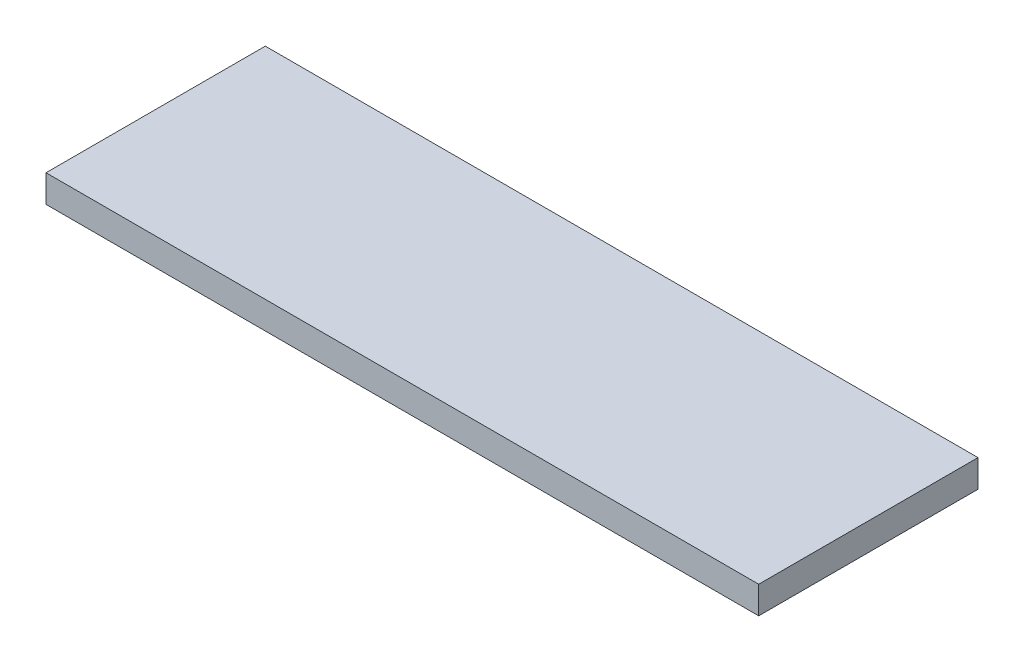
ISO-10303-21;
HEADER;
FILE_DESCRIPTION(('STEP AP214'),'2;1');
FILE_NAME('part.step','',(''),(''),'','','');
FILE_SCHEMA(('AUTOMOTIVE_DESIGN { 1 0 10303 214 1 1 1 1 }'));
ENDSEC;
DATA;
#1=APPLICATION_CONTEXT('core data for automotive mechanical design processes');
#2=APPLICATION_PROTOCOL_DEFINITION('international standard','automotive_design',2000,#1);
#3=PRODUCT_CONTEXT('',#1,'mechanical');
#4=PRODUCT('Part','Part','',(#3));
#5=PRODUCT_RELATED_PRODUCT_CATEGORY('part','',(#4));
#6=PRODUCT_DEFINITION_FORMATION('','',#4);
#7=PRODUCT_DEFINITION_CONTEXT('part definition',#1,'design');
#8=PRODUCT_DEFINITION('design','',#6,#7);
#9=PRODUCT_DEFINITION_SHAPE('','',#8);
#10=(LENGTH_UNIT() NAMED_UNIT(*) SI_UNIT(.MILLI.,.METRE.));
#11=(NAMED_UNIT(*) PLANE_ANGLE_UNIT() SI_UNIT($,.RADIAN.));
#12=(NAMED_UNIT(*) SI_UNIT($,.STERADIAN.) SOLID_ANGLE_UNIT());
#13=UNCERTAINTY_MEASURE_WITH_UNIT(LENGTH_MEASURE(1.E-05),#10,'distance_accuracy_value','');
#14=(GEOMETRIC_REPRESENTATION_CONTEXT(3) GLOBAL_UNCERTAINTY_ASSIGNED_CONTEXT((#13)) GLOBAL_UNIT_ASSIGNED_CONTEXT((#10,
#11,#12)) REPRESENTATION_CONTEXT('',''));
#15=CARTESIAN_POINT('',(0.,0.,0.));
#16=DIRECTION('',(0.,0.,1.));
#17=DIRECTION('',(1.,0.,0.));
#18=AXIS2_PLACEMENT_3D('',#15,#16,#17);
#19=CARTESIAN_POINT('',(-60.3433998794003,12.7,-83.2943818801178));
#20=DIRECTION('',(1.,0.,0.));
#21=DIRECTION('',(0.,0.,-1.));
#22=AXIS2_PLACEMENT_3D('',#19,#20,#21);
#23=PLANE('',#22);
#24=DIRECTION('',(0.,0.,1.));
#25=VECTOR('',#24,1.);
#26=CARTESIAN_POINT('',(-60.3433998794003,0.,-83.2943818801178));
#27=LINE('',#26,#25);
#28=CARTESIAN_POINT('',(-60.3433998794003,0.,-83.2943818801178));
#29=VERTEX_POINT('',#28);
#30=CARTESIAN_POINT('',(-60.3433998794003,0.,18.3056181198822));
#31=VERTEX_POINT('',#30);
#32=EDGE_CURVE('E98',#29,#31,#27,.T.);
#33=ORIENTED_EDGE('',*,*,#32,.T.);
#34=DIRECTION('',(0.,-1.,0.));
#35=VECTOR('',#34,1.);
#36=CARTESIAN_POINT('',(-60.3433998794003,12.7,18.3056181198822));
#37=LINE('',#36,#35);
#38=CARTESIAN_POINT('',(-60.3433998794003,12.7,18.3056181198822));
#39=VERTEX_POINT('',#38);
#40=EDGE_CURVE('E11',#39,#31,#37,.T.);
#41=ORIENTED_EDGE('',*,*,#40,.F.);
#42=DIRECTION('',(0.,0.,1.));
#43=VECTOR('',#42,1.);
#44=CARTESIAN_POINT('',(-60.3433998794003,12.7,-83.2943818801178));
#45=LINE('',#44,#43);
#46=CARTESIAN_POINT('',(-60.3433998794003,12.7,-83.2943818801178));
#47=VERTEX_POINT('',#46);
#48=EDGE_CURVE('E86',#47,#39,#45,.T.);
#49=ORIENTED_EDGE('',*,*,#48,.F.);
#50=DIRECTION('',(0.,-1.,0.));
#51=VECTOR('',#50,1.);
#52=CARTESIAN_POINT('',(-60.3433998794003,12.7,-83.2943818801178));
#53=LINE('',#52,#51);
#54=EDGE_CURVE('E94',#47,#29,#53,.T.);
#55=ORIENTED_EDGE('',*,*,#54,.T.);
#56=EDGE_LOOP('',(#33,#41,#49,#55));
#57=FACE_BOUND('',#56,.T.);
#58=ADVANCED_FACE('F35',(#57),#23,.F.);
#59=CARTESIAN_POINT('',(-60.3433998794003,12.7,18.3056181198822));
#60=DIRECTION('',(0.,0.,-1.));
#61=DIRECTION('',(-1.,0.,0.));
#62=AXIS2_PLACEMENT_3D('',#59,#60,#61);
#63=PLANE('',#62);
#64=DIRECTION('',(1.,0.,0.));
#65=VECTOR('',#64,1.);
#66=CARTESIAN_POINT('',(-60.3433998794003,0.,18.3056181198822));
#67=LINE('',#66,#65);
#68=CARTESIAN_POINT('',(269.8566001206,0.,18.3056181198822));
#69=VERTEX_POINT('',#68);
#70=EDGE_CURVE('E90',#31,#69,#67,.T.);
#71=ORIENTED_EDGE('',*,*,#70,.T.);
#72=DIRECTION('',(0.,-1.,0.));
#73=VECTOR('',#72,1.);
#74=CARTESIAN_POINT('',(269.8566001206,12.7,18.3056181198822));
#75=LINE('',#74,#73);
#76=CARTESIAN_POINT('',(269.8566001206,12.7,18.3056181198822));
#77=VERTEX_POINT('',#76);
#78=EDGE_CURVE('E43',#77,#69,#75,.T.);
#79=ORIENTED_EDGE('',*,*,#78,.F.);
#80=DIRECTION('',(1.,0.,0.));
#81=VECTOR('',#80,1.);
#82=CARTESIAN_POINT('',(-60.3433998794003,12.7,18.3056181198822));
#83=LINE('',#82,#81);
#84=EDGE_CURVE('E81',#39,#77,#83,.T.);
#85=ORIENTED_EDGE('',*,*,#84,.F.);
#86=ORIENTED_EDGE('',*,*,#40,.T.);
#87=EDGE_LOOP('',(#71,#79,#85,#86));
#88=FACE_BOUND('',#87,.T.);
#89=ADVANCED_FACE('F89',(#88),#63,.F.);
#90=CARTESIAN_POINT('',(269.8566001206,12.7,-83.2943818801178));
#91=DIRECTION('',(-1.,0.,0.));
#92=DIRECTION('',(0.,0.,1.));
#93=AXIS2_PLACEMENT_3D('',#90,#91,#92);
#94=PLANE('',#93);
#95=DIRECTION('',(0.,0.,-1.));
#96=VECTOR('',#95,1.);
#97=CARTESIAN_POINT('',(269.8566001206,0.,-83.2943818801178));
#98=LINE('',#97,#96);
#99=CARTESIAN_POINT('',(269.8566001206,0.,-83.2943818801178));
#100=VERTEX_POINT('',#99);
#101=EDGE_CURVE('E68',#69,#100,#98,.T.);
#102=ORIENTED_EDGE('',*,*,#101,.T.);
#103=DIRECTION('',(0.,-1.,0.));
#104=VECTOR('',#103,1.);
#105=CARTESIAN_POINT('',(269.8566001206,12.7,-83.2943818801178));
#106=LINE('',#105,#104);
#107=CARTESIAN_POINT('',(269.8566001206,12.7,-83.2943818801178));
#108=VERTEX_POINT('',#107);
#109=EDGE_CURVE('E91',#108,#100,#106,.T.);
#110=ORIENTED_EDGE('',*,*,#109,.F.);
#111=DIRECTION('',(0.,0.,-1.));
#112=VECTOR('',#111,1.);
#113=CARTESIAN_POINT('',(269.8566001206,12.7,-83.2943818801178));
#114=LINE('',#113,#112);
#115=EDGE_CURVE('E84',#77,#108,#114,.T.);
#116=ORIENTED_EDGE('',*,*,#115,.F.);
#117=ORIENTED_EDGE('',*,*,#78,.T.);
#118=EDGE_LOOP('',(#102,#110,#116,#117));
#119=FACE_BOUND('',#118,.T.);
#120=ADVANCED_FACE('F92',(#119),#94,.F.);
#121=CARTESIAN_POINT('',(-60.3433998794003,12.7,-83.2943818801178));
#122=DIRECTION('',(0.,0.,1.));
#123=DIRECTION('',(1.,0.,0.));
#124=AXIS2_PLACEMENT_3D('',#121,#122,#123);
#125=PLANE('',#124);
#126=DIRECTION('',(-1.,0.,0.));
#127=VECTOR('',#126,1.);
#128=CARTESIAN_POINT('',(-60.3433998794003,0.,-83.2943818801178));
#129=LINE('',#128,#127);
#130=EDGE_CURVE('E74',#100,#29,#129,.T.);
#131=ORIENTED_EDGE('',*,*,#130,.T.);
#132=ORIENTED_EDGE('',*,*,#54,.F.);
#133=DIRECTION('',(-1.,0.,0.));
#134=VECTOR('',#133,1.);
#135=CARTESIAN_POINT('',(-60.3433998794003,12.7,-83.2943818801178));
#136=LINE('',#135,#134);
#137=EDGE_CURVE('E51',#108,#47,#136,.T.);
#138=ORIENTED_EDGE('',*,*,#137,.F.);
#139=ORIENTED_EDGE('',*,*,#109,.T.);
#140=EDGE_LOOP('',(#131,#132,#138,#139));
#141=FACE_BOUND('',#140,.T.);
#142=ADVANCED_FACE('F105',(#141),#125,.F.);
#143=CARTESIAN_POINT('',(0.,12.7,0.));
#144=DIRECTION('',(0.,1.,0.));
#145=DIRECTION('',(0.,0.,1.));
#146=AXIS2_PLACEMENT_3D('',#143,#144,#145);
#147=PLANE('',#146);
#148=ORIENTED_EDGE('',*,*,#48,.T.);
#149=ORIENTED_EDGE('',*,*,#84,.T.);
#150=ORIENTED_EDGE('',*,*,#115,.T.);
#151=ORIENTED_EDGE('',*,*,#137,.T.);
#152=EDGE_LOOP('',(#148,#149,#150,#151));
#153=FACE_BOUND('',#152,.T.);
#154=ADVANCED_FACE('F82',(#153),#147,.T.);
#155=CARTESIAN_POINT('',(0.,0.,0.));
#156=DIRECTION('',(0.,1.,0.));
#157=DIRECTION('',(0.,0.,1.));
#158=AXIS2_PLACEMENT_3D('',#155,#156,#157);
#159=PLANE('',#158);
#160=ORIENTED_EDGE('',*,*,#32,.F.);
#161=ORIENTED_EDGE('',*,*,#130,.F.);
#162=ORIENTED_EDGE('',*,*,#101,.F.);
#163=ORIENTED_EDGE('',*,*,#70,.F.);
#164=EDGE_LOOP('',(#160,#161,#162,#163));
#165=FACE_BOUND('',#164,.T.);
#166=ADVANCED_FACE('F108',(#165),#159,.F.);
#167=CLOSED_SHELL('',(#58,#89,#120,#142,#154,#166));
#168=MANIFOLD_SOLID_BREP('B2',#167);
#169=ADVANCED_BREP_SHAPE_REPRESENTATION('',(#18,#168),#14);
#170=SHAPE_DEFINITION_REPRESENTATION(#9,#169);
ENDSEC;
END-ISO-10303-21;
